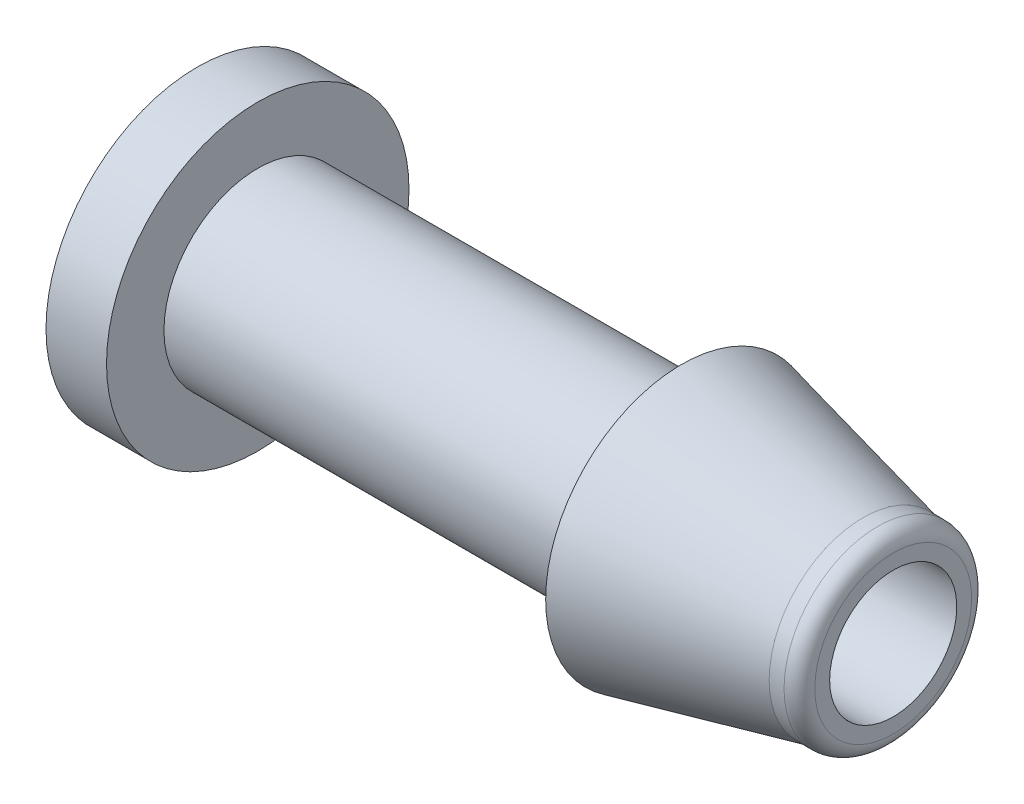
ISO-10303-21;
HEADER;
FILE_DESCRIPTION(('STEP AP214'),'2;1');
FILE_NAME('part.step','',(''),(''),'','','');
FILE_SCHEMA(('AUTOMOTIVE_DESIGN { 1 0 10303 214 1 1 1 1 }'));
ENDSEC;
DATA;
#1=APPLICATION_CONTEXT('core data for automotive mechanical design processes');
#2=APPLICATION_PROTOCOL_DEFINITION('international standard','automotive_design',2000,#1);
#3=PRODUCT_CONTEXT('',#1,'mechanical');
#4=PRODUCT('Part','Part','',(#3));
#5=PRODUCT_RELATED_PRODUCT_CATEGORY('part','',(#4));
#6=PRODUCT_DEFINITION_FORMATION('','',#4);
#7=PRODUCT_DEFINITION_CONTEXT('part definition',#1,'design');
#8=PRODUCT_DEFINITION('design','',#6,#7);
#9=PRODUCT_DEFINITION_SHAPE('','',#8);
#10=(LENGTH_UNIT() NAMED_UNIT(*) SI_UNIT(.MILLI.,.METRE.));
#11=(NAMED_UNIT(*) PLANE_ANGLE_UNIT() SI_UNIT($,.RADIAN.));
#12=(NAMED_UNIT(*) SI_UNIT($,.STERADIAN.) SOLID_ANGLE_UNIT());
#13=UNCERTAINTY_MEASURE_WITH_UNIT(LENGTH_MEASURE(1.E-05),#10,'distance_accuracy_value','');
#14=(GEOMETRIC_REPRESENTATION_CONTEXT(3) GLOBAL_UNCERTAINTY_ASSIGNED_CONTEXT((#13)) GLOBAL_UNIT_ASSIGNED_CONTEXT((#10,
#11,#12)) REPRESENTATION_CONTEXT('',''));
#15=CARTESIAN_POINT('',(0.,0.,0.));
#16=DIRECTION('',(0.,0.,1.));
#17=DIRECTION('',(1.,0.,0.));
#18=AXIS2_PLACEMENT_3D('',#15,#16,#17);
#19=CARTESIAN_POINT('',(0.,0.,0.));
#20=DIRECTION('',(-1.,0.,0.));
#21=DIRECTION('',(0.,0.,1.));
#22=AXIS2_PLACEMENT_3D('',#19,#20,#21);
#23=CYLINDRICAL_SURFACE('',#22,2.1);
#24=CARTESIAN_POINT('',(21.,0.,0.));
#25=DIRECTION('',(-1.,0.,0.));
#26=DIRECTION('',(0.,0.,1.));
#27=AXIS2_PLACEMENT_3D('',#24,#25,#26);
#28=CIRCLE('',#27,2.1);
#29=CARTESIAN_POINT('',(21.,0.,2.1));
#30=VERTEX_POINT('',#29);
#31=EDGE_CURVE('E10',#30,#30,#28,.T.);
#32=ORIENTED_EDGE('',*,*,#31,.F.);
#33=EDGE_LOOP('',(#32));
#34=FACE_BOUND('',#33,.T.);
#35=CARTESIAN_POINT('',(-2.,0.,0.));
#36=DIRECTION('',(-1.,0.,0.));
#37=DIRECTION('',(0.,0.,1.));
#38=AXIS2_PLACEMENT_3D('',#35,#36,#37);
#39=CIRCLE('',#38,2.1);
#40=CARTESIAN_POINT('',(-2.,0.,2.1));
#41=VERTEX_POINT('',#40);
#42=EDGE_CURVE('E77',#41,#41,#39,.T.);
#43=ORIENTED_EDGE('',*,*,#42,.T.);
#44=EDGE_LOOP('',(#43));
#45=FACE_BOUND('',#44,.T.);
#46=ADVANCED_FACE('F37',(#34,#45),#23,.F.);
#47=CARTESIAN_POINT('',(21.,2.592,0.));
#48=DIRECTION('',(-1.,0.,0.));
#49=DIRECTION('',(0.,0.,1.));
#50=AXIS2_PLACEMENT_3D('',#47,#48,#49);
#51=PLANE('',#50);
#52=CARTESIAN_POINT('',(21.,0.,0.));
#53=DIRECTION('',(-1.,0.,0.));
#54=DIRECTION('',(0.,0.,1.));
#55=AXIS2_PLACEMENT_3D('',#52,#53,#54);
#56=CIRCLE('',#55,2.592);
#57=CARTESIAN_POINT('',(21.,0.,2.592));
#58=VERTEX_POINT('',#57);
#59=EDGE_CURVE('E44',#58,#58,#56,.T.);
#60=ORIENTED_EDGE('',*,*,#59,.F.);
#61=EDGE_LOOP('',(#60));
#62=FACE_BOUND('',#61,.T.);
#63=ORIENTED_EDGE('',*,*,#31,.T.);
#64=EDGE_LOOP('',(#63));
#65=FACE_BOUND('',#64,.T.);
#66=ADVANCED_FACE('F103',(#62,#65),#51,.F.);
#67=CARTESIAN_POINT('',(20.492,0.,0.));
#68=DIRECTION('',(-1.,0.,0.));
#69=DIRECTION('',(0.,0.,1.));
#70=AXIS2_PLACEMENT_3D('',#67,#68,#69);
#71=TOROIDAL_SURFACE('',#70,2.592,0.508000000000002);
#72=CARTESIAN_POINT('',(20.492,0.,0.));
#73=DIRECTION('',(-1.,0.,0.));
#74=DIRECTION('',(0.,0.,1.));
#75=AXIS2_PLACEMENT_3D('',#72,#73,#74);
#76=CIRCLE('',#75,3.1);
#77=CARTESIAN_POINT('',(20.492,0.,3.1));
#78=VERTEX_POINT('',#77);
#79=EDGE_CURVE('E49',#78,#78,#76,.T.);
#80=ORIENTED_EDGE('',*,*,#79,.F.);
#81=EDGE_LOOP('',(#80));
#82=FACE_BOUND('',#81,.T.);
#83=ORIENTED_EDGE('',*,*,#59,.T.);
#84=EDGE_LOOP('',(#83));
#85=FACE_BOUND('',#84,.T.);
#86=ADVANCED_FACE('F108',(#82,#85),#71,.T.);
#87=CARTESIAN_POINT('',(0.,0.,0.));
#88=DIRECTION('',(-1.,0.,0.));
#89=DIRECTION('',(0.,0.,1.));
#90=AXIS2_PLACEMENT_3D('',#87,#88,#89);
#91=CYLINDRICAL_SURFACE('',#90,3.1);
#92=CARTESIAN_POINT('',(20.,0.,0.));
#93=DIRECTION('',(-1.,0.,0.));
#94=DIRECTION('',(0.,0.,1.));
#95=AXIS2_PLACEMENT_3D('',#92,#93,#94);
#96=CIRCLE('',#95,3.1);
#97=CARTESIAN_POINT('',(20.,0.,3.1));
#98=VERTEX_POINT('',#97);
#99=EDGE_CURVE('E54',#98,#98,#96,.T.);
#100=ORIENTED_EDGE('',*,*,#99,.F.);
#101=EDGE_LOOP('',(#100));
#102=FACE_BOUND('',#101,.T.);
#103=ORIENTED_EDGE('',*,*,#79,.T.);
#104=EDGE_LOOP('',(#103));
#105=FACE_BOUND('',#104,.T.);
#106=ADVANCED_FACE('F113',(#102,#105),#91,.T.);
#107=CARTESIAN_POINT('',(20.,0.,0.));
#108=DIRECTION('',(-1.,0.,0.));
#109=DIRECTION('',(0.,0.,1.));
#110=AXIS2_PLACEMENT_3D('',#107,#108,#109);
#111=CONICAL_SURFACE('',#110,3.1,0.226892802759263);
#112=CARTESIAN_POINT('',(14.,0.,0.));
#113=DIRECTION('',(-1.,0.,0.));
#114=DIRECTION('',(0.,0.,1.));
#115=AXIS2_PLACEMENT_3D('',#112,#113,#114);
#116=CIRCLE('',#115,4.48520914675338);
#117=CARTESIAN_POINT('',(14.,0.,4.48520914675338));
#118=VERTEX_POINT('',#117);
#119=EDGE_CURVE('E60',#118,#118,#116,.T.);
#120=ORIENTED_EDGE('',*,*,#119,.F.);
#121=EDGE_LOOP('',(#120));
#122=FACE_BOUND('',#121,.T.);
#123=ORIENTED_EDGE('',*,*,#99,.T.);
#124=EDGE_LOOP('',(#123));
#125=FACE_BOUND('',#124,.T.);
#126=ADVANCED_FACE('F119',(#122,#125),#111,.T.);
#127=CARTESIAN_POINT('',(14.,3.1,0.));
#128=DIRECTION('',(1.,0.,0.));
#129=DIRECTION('',(0.,0.,-1.));
#130=AXIS2_PLACEMENT_3D('',#127,#128,#129);
#131=PLANE('',#130);
#132=CARTESIAN_POINT('',(14.,0.,0.));
#133=DIRECTION('',(-1.,0.,0.));
#134=DIRECTION('',(0.,0.,1.));
#135=AXIS2_PLACEMENT_3D('',#132,#133,#134);
#136=CIRCLE('',#135,3.1);
#137=CARTESIAN_POINT('',(14.,0.,3.1));
#138=VERTEX_POINT('',#137);
#139=EDGE_CURVE('E64',#138,#138,#136,.T.);
#140=ORIENTED_EDGE('',*,*,#139,.F.);
#141=EDGE_LOOP('',(#140));
#142=FACE_BOUND('',#141,.T.);
#143=ORIENTED_EDGE('',*,*,#119,.T.);
#144=EDGE_LOOP('',(#143));
#145=FACE_BOUND('',#144,.T.);
#146=ADVANCED_FACE('F100',(#142,#145),#131,.F.);
#147=CARTESIAN_POINT('',(0.,0.,0.));
#148=DIRECTION('',(-1.,0.,0.));
#149=DIRECTION('',(0.,0.,1.));
#150=AXIS2_PLACEMENT_3D('',#147,#148,#149);
#151=CYLINDRICAL_SURFACE('',#150,3.1);
#152=CARTESIAN_POINT('',(0.,0.,0.));
#153=DIRECTION('',(-1.,0.,0.));
#154=DIRECTION('',(0.,0.,1.));
#155=AXIS2_PLACEMENT_3D('',#152,#153,#154);
#156=CIRCLE('',#155,3.1);
#157=CARTESIAN_POINT('',(0.,0.,3.1));
#158=VERTEX_POINT('',#157);
#159=EDGE_CURVE('E68',#158,#158,#156,.T.);
#160=ORIENTED_EDGE('',*,*,#159,.F.);
#161=EDGE_LOOP('',(#160));
#162=FACE_BOUND('',#161,.T.);
#163=ORIENTED_EDGE('',*,*,#139,.T.);
#164=EDGE_LOOP('',(#163));
#165=FACE_BOUND('',#164,.T.);
#166=ADVANCED_FACE('F89',(#162,#165),#151,.T.);
#167=CARTESIAN_POINT('',(-2.,0.,0.));
#168=DIRECTION('',(-1.,0.,0.));
#169=DIRECTION('',(0.,0.,1.));
#170=AXIS2_PLACEMENT_3D('',#167,#168,#169);
#171=PLANE('',#170);
#172=CARTESIAN_POINT('',(-2.,0.,0.));
#173=DIRECTION('',(-1.,0.,0.));
#174=DIRECTION('',(0.,0.,1.));
#175=AXIS2_PLACEMENT_3D('',#172,#173,#174);
#176=CIRCLE('',#175,4.99790373054634);
#177=CARTESIAN_POINT('',(-2.,0.,4.99790373054634));
#178=VERTEX_POINT('',#177);
#179=EDGE_CURVE('E72',#178,#178,#176,.T.);
#180=ORIENTED_EDGE('',*,*,#179,.T.);
#181=EDGE_LOOP('',(#180));
#182=FACE_BOUND('',#181,.T.);
#183=ORIENTED_EDGE('',*,*,#42,.F.);
#184=EDGE_LOOP('',(#183));
#185=FACE_BOUND('',#184,.T.);
#186=ADVANCED_FACE('F86',(#182,#185),#171,.T.);
#187=CARTESIAN_POINT('',(0.,0.,0.));
#188=DIRECTION('',(-1.,0.,0.));
#189=DIRECTION('',(0.,0.,1.));
#190=AXIS2_PLACEMENT_3D('',#187,#188,#189);
#191=PLANE('',#190);
#192=ORIENTED_EDGE('',*,*,#159,.T.);
#193=EDGE_LOOP('',(#192));
#194=FACE_BOUND('',#193,.T.);
#195=CARTESIAN_POINT('',(0.,0.,0.));
#196=DIRECTION('',(-1.,0.,0.));
#197=DIRECTION('',(0.,0.,1.));
#198=AXIS2_PLACEMENT_3D('',#195,#196,#197);
#199=CIRCLE('',#198,4.99790373054634);
#200=CARTESIAN_POINT('',(0.,0.,4.99790373054634));
#201=VERTEX_POINT('',#200);
#202=EDGE_CURVE('E73',#201,#201,#199,.T.);
#203=ORIENTED_EDGE('',*,*,#202,.F.);
#204=EDGE_LOOP('',(#203));
#205=FACE_BOUND('',#204,.T.);
#206=ADVANCED_FACE('F88',(#194,#205),#191,.F.);
#207=CARTESIAN_POINT('',(-2.,0.,0.));
#208=DIRECTION('',(1.,0.,0.));
#209=DIRECTION('',(0.,0.,-1.));
#210=AXIS2_PLACEMENT_3D('',#207,#208,#209);
#211=CYLINDRICAL_SURFACE('',#210,4.99790373054634);
#212=ORIENTED_EDGE('',*,*,#179,.F.);
#213=EDGE_LOOP('',(#212));
#214=FACE_BOUND('',#213,.T.);
#215=ORIENTED_EDGE('',*,*,#202,.T.);
#216=EDGE_LOOP('',(#215));
#217=FACE_BOUND('',#216,.T.);
#218=ADVANCED_FACE('F96',(#214,#217),#211,.T.);
#219=CLOSED_SHELL('',(#46,#66,#86,#106,#126,#146,#166,#186,#206,#218));
#220=MANIFOLD_SOLID_BREP('B2',#219);
#221=ADVANCED_BREP_SHAPE_REPRESENTATION('',(#18,#220),#14);
#222=SHAPE_DEFINITION_REPRESENTATION(#9,#221);
ENDSEC;
END-ISO-10303-21;
